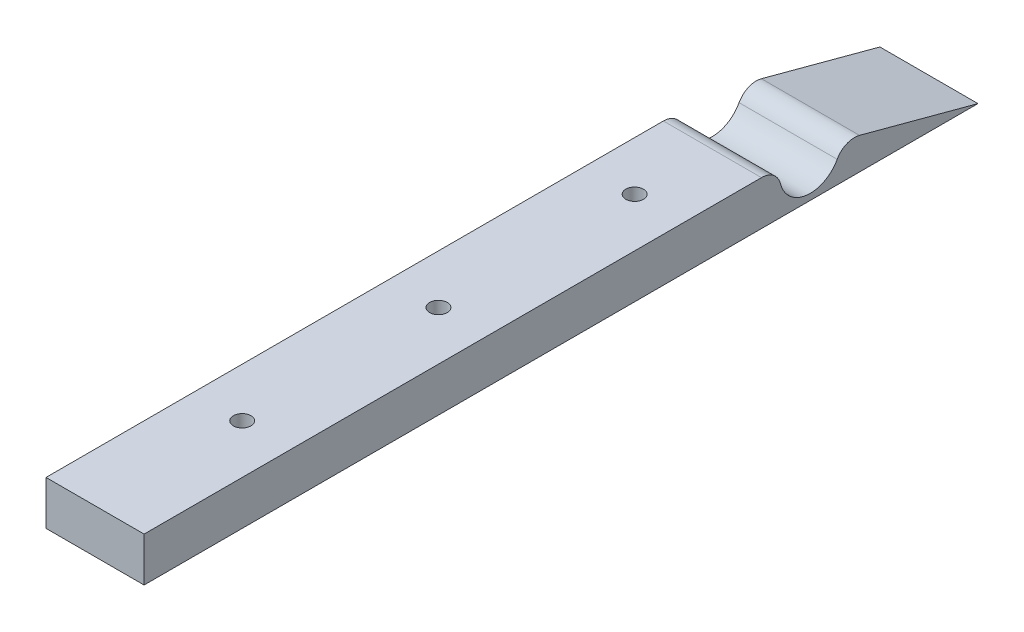
ISO-10303-21;
HEADER;
FILE_DESCRIPTION(('STEP AP214'),'2;1');
FILE_NAME('part.step','',(''),(''),'','','');
FILE_SCHEMA(('AUTOMOTIVE_DESIGN { 1 0 10303 214 1 1 1 1 }'));
ENDSEC;
DATA;
#1=APPLICATION_CONTEXT('core data for automotive mechanical design processes');
#2=APPLICATION_PROTOCOL_DEFINITION('international standard','automotive_design',2000,#1);
#3=PRODUCT_CONTEXT('',#1,'mechanical');
#4=PRODUCT('Part','Part','',(#3));
#5=PRODUCT_RELATED_PRODUCT_CATEGORY('part','',(#4));
#6=PRODUCT_DEFINITION_FORMATION('','',#4);
#7=PRODUCT_DEFINITION_CONTEXT('part definition',#1,'design');
#8=PRODUCT_DEFINITION('design','',#6,#7);
#9=PRODUCT_DEFINITION_SHAPE('','',#8);
#10=(LENGTH_UNIT() NAMED_UNIT(*) SI_UNIT(.MILLI.,.METRE.));
#11=(NAMED_UNIT(*) PLANE_ANGLE_UNIT() SI_UNIT($,.RADIAN.));
#12=(NAMED_UNIT(*) SI_UNIT($,.STERADIAN.) SOLID_ANGLE_UNIT());
#13=UNCERTAINTY_MEASURE_WITH_UNIT(LENGTH_MEASURE(1.E-05),#10,'distance_accuracy_value','');
#14=(GEOMETRIC_REPRESENTATION_CONTEXT(3) GLOBAL_UNCERTAINTY_ASSIGNED_CONTEXT((#13)) GLOBAL_UNIT_ASSIGNED_CONTEXT((#10,
#11,#12)) REPRESENTATION_CONTEXT('',''));
#15=CARTESIAN_POINT('',(0.,0.,0.));
#16=DIRECTION('',(0.,0.,1.));
#17=DIRECTION('',(1.,0.,0.));
#18=AXIS2_PLACEMENT_3D('',#15,#16,#17);
#19=CARTESIAN_POINT('',(12.6999999999996,11.43,-38.1));
#20=DIRECTION('',(0.,-1.,0.));
#21=DIRECTION('',(0.,0.,-1.));
#22=AXIS2_PLACEMENT_3D('',#19,#20,#21);
#23=CYLINDRICAL_SURFACE('',#22,2.286);
#24=CARTESIAN_POINT('',(12.6999999999996,11.43,-38.1));
#25=DIRECTION('',(0.,-1.,0.));
#26=DIRECTION('',(0.,0.,-1.));
#27=AXIS2_PLACEMENT_3D('',#24,#25,#26);
#28=CIRCLE('',#27,2.286);
#29=CARTESIAN_POINT('',(12.6999999999996,11.43,-40.386));
#30=VERTEX_POINT('',#29);
#31=EDGE_CURVE('E353',#30,#30,#28,.T.);
#32=ORIENTED_EDGE('',*,*,#31,.F.);
#33=EDGE_LOOP('',(#32));
#34=FACE_BOUND('',#33,.T.);
#35=CARTESIAN_POINT('',(12.6999999999996,6.35,-38.1));
#36=DIRECTION('',(0.,-1.,0.));
#37=DIRECTION('',(0.,0.,-1.));
#38=AXIS2_PLACEMENT_3D('',#35,#36,#37);
#39=CIRCLE('',#38,2.286);
#40=CARTESIAN_POINT('',(12.6999999999996,6.35,-40.386));
#41=VERTEX_POINT('',#40);
#42=EDGE_CURVE('E37',#41,#41,#39,.F.);
#43=ORIENTED_EDGE('',*,*,#42,.F.);
#44=EDGE_LOOP('',(#43));
#45=FACE_BOUND('',#44,.T.);
#46=ADVANCED_FACE('F33',(#34,#45),#23,.F.);
#47=CARTESIAN_POINT('',(12.6999999999998,11.43,-88.9));
#48=DIRECTION('',(0.,-1.,0.));
#49=DIRECTION('',(0.,0.,-1.));
#50=AXIS2_PLACEMENT_3D('',#47,#48,#49);
#51=CYLINDRICAL_SURFACE('',#50,2.286);
#52=CARTESIAN_POINT('',(12.6999999999998,11.43,-88.9));
#53=DIRECTION('',(0.,-1.,0.));
#54=DIRECTION('',(0.,0.,-1.));
#55=AXIS2_PLACEMENT_3D('',#52,#53,#54);
#56=CIRCLE('',#55,2.286);
#57=CARTESIAN_POINT('',(12.6999999999998,11.43,-91.186));
#58=VERTEX_POINT('',#57);
#59=EDGE_CURVE('E356',#58,#58,#56,.T.);
#60=ORIENTED_EDGE('',*,*,#59,.F.);
#61=EDGE_LOOP('',(#60));
#62=FACE_BOUND('',#61,.T.);
#63=CARTESIAN_POINT('',(12.6999999999998,6.35,-88.9));
#64=DIRECTION('',(0.,-1.,0.));
#65=DIRECTION('',(0.,0.,-1.));
#66=AXIS2_PLACEMENT_3D('',#63,#64,#65);
#67=CIRCLE('',#66,2.286);
#68=CARTESIAN_POINT('',(12.6999999999998,6.35,-91.186));
#69=VERTEX_POINT('',#68);
#70=EDGE_CURVE('E294',#69,#69,#67,.F.);
#71=ORIENTED_EDGE('',*,*,#70,.F.);
#72=EDGE_LOOP('',(#71));
#73=FACE_BOUND('',#72,.T.);
#74=ADVANCED_FACE('F415',(#62,#73),#51,.F.);
#75=CARTESIAN_POINT('',(12.7,11.43,-139.7));
#76=DIRECTION('',(0.,-1.,0.));
#77=DIRECTION('',(0.,0.,-1.));
#78=AXIS2_PLACEMENT_3D('',#75,#76,#77);
#79=CYLINDRICAL_SURFACE('',#78,2.286);
#80=CARTESIAN_POINT('',(12.7,11.43,-139.7));
#81=DIRECTION('',(0.,-1.,0.));
#82=DIRECTION('',(0.,0.,-1.));
#83=AXIS2_PLACEMENT_3D('',#80,#81,#82);
#84=CIRCLE('',#83,2.286);
#85=CARTESIAN_POINT('',(12.7,11.43,-141.986));
#86=VERTEX_POINT('',#85);
#87=EDGE_CURVE('E359',#86,#86,#84,.T.);
#88=ORIENTED_EDGE('',*,*,#87,.F.);
#89=EDGE_LOOP('',(#88));
#90=FACE_BOUND('',#89,.T.);
#91=CARTESIAN_POINT('',(12.7,6.35,-139.7));
#92=DIRECTION('',(0.,-1.,0.));
#93=DIRECTION('',(0.,0.,-1.));
#94=AXIS2_PLACEMENT_3D('',#91,#92,#93);
#95=CIRCLE('',#94,2.286);
#96=CARTESIAN_POINT('',(12.7,6.35,-141.986));
#97=VERTEX_POINT('',#96);
#98=EDGE_CURVE('E342',#97,#97,#95,.F.);
#99=ORIENTED_EDGE('',*,*,#98,.F.);
#100=EDGE_LOOP('',(#99));
#101=FACE_BOUND('',#100,.T.);
#102=ADVANCED_FACE('F417',(#90,#101),#79,.F.);
#103=CARTESIAN_POINT('',(25.4,0.,0.));
#104=DIRECTION('',(0.,0.,-1.));
#105=DIRECTION('',(-1.,0.,0.));
#106=AXIS2_PLACEMENT_3D('',#103,#104,#105);
#107=PLANE('',#106);
#108=DIRECTION('',(0.,-1.,0.));
#109=VECTOR('',#108,1.);
#110=CARTESIAN_POINT('',(0.,0.,0.));
#111=LINE('',#110,#109);
#112=CARTESIAN_POINT('',(0.,11.43,0.));
#113=VERTEX_POINT('',#112);
#114=CARTESIAN_POINT('',(0.,0.,0.));
#115=VERTEX_POINT('',#114);
#116=EDGE_CURVE('E362',#113,#115,#111,.T.);
#117=ORIENTED_EDGE('',*,*,#116,.T.);
#118=DIRECTION('',(-1.,0.,0.));
#119=VECTOR('',#118,1.);
#120=CARTESIAN_POINT('',(25.4,0.,0.));
#121=LINE('',#120,#119);
#122=CARTESIAN_POINT('',(25.4,0.,0.));
#123=VERTEX_POINT('',#122);
#124=EDGE_CURVE('E11',#123,#115,#121,.T.);
#125=ORIENTED_EDGE('',*,*,#124,.F.);
#126=DIRECTION('',(0.,-1.,0.));
#127=VECTOR('',#126,1.);
#128=CARTESIAN_POINT('',(25.4,0.,0.));
#129=LINE('',#128,#127);
#130=CARTESIAN_POINT('',(25.4,11.43,0.));
#131=VERTEX_POINT('',#130);
#132=EDGE_CURVE('E363',#131,#123,#129,.T.);
#133=ORIENTED_EDGE('',*,*,#132,.F.);
#134=DIRECTION('',(-1.,0.,0.));
#135=VECTOR('',#134,1.);
#136=CARTESIAN_POINT('',(25.4,11.43,0.));
#137=LINE('',#136,#135);
#138=EDGE_CURVE('E379',#131,#113,#137,.T.);
#139=ORIENTED_EDGE('',*,*,#138,.T.);
#140=EDGE_LOOP('',(#117,#125,#133,#139));
#141=FACE_BOUND('',#140,.T.);
#142=ADVANCED_FACE('F35',(#141),#107,.F.);
#143=CARTESIAN_POINT('',(25.4,0.,0.));
#144=DIRECTION('',(0.,1.,0.));
#145=DIRECTION('',(0.,0.,1.));
#146=AXIS2_PLACEMENT_3D('',#143,#144,#145);
#147=PLANE('',#146);
#148=DIRECTION('',(-0.5,0.,0.866025403784438));
#149=VECTOR('',#148,1.);
#150=CARTESIAN_POINT('',(18.1259378298438,0.,-38.1));
#151=LINE('',#150,#149);
#152=CARTESIAN_POINT('',(18.1259378298437,0.,-38.1));
#153=VERTEX_POINT('',#152);
#154=CARTESIAN_POINT('',(15.4129689149217,0.,-33.401));
#155=VERTEX_POINT('',#154);
#156=EDGE_CURVE('E238',#153,#155,#151,.T.);
#157=ORIENTED_EDGE('',*,*,#156,.F.);
#158=DIRECTION('',(0.500000000000001,0.,0.866025403784438));
#159=VECTOR('',#158,1.);
#160=CARTESIAN_POINT('',(15.4129689149217,0.,-42.799));
#161=LINE('',#160,#159);
#162=CARTESIAN_POINT('',(15.4129689149217,0.,-42.799));
#163=VERTEX_POINT('',#162);
#164=EDGE_CURVE('E50',#163,#153,#161,.T.);
#165=ORIENTED_EDGE('',*,*,#164,.F.);
#166=DIRECTION('',(1.,0.,0.));
#167=VECTOR('',#166,1.);
#168=CARTESIAN_POINT('',(9.98703108507759,0.,-42.799));
#169=LINE('',#168,#167);
#170=CARTESIAN_POINT('',(9.98703108507759,0.,-42.799));
#171=VERTEX_POINT('',#170);
#172=EDGE_CURVE('E224',#171,#163,#169,.T.);
#173=ORIENTED_EDGE('',*,*,#172,.F.);
#174=DIRECTION('',(0.500000000000001,0.,-0.866025403784438));
#175=VECTOR('',#174,1.);
#176=CARTESIAN_POINT('',(7.27406217015554,0.,-38.1));
#177=LINE('',#176,#175);
#178=CARTESIAN_POINT('',(7.27406217015554,0.,-38.1));
#179=VERTEX_POINT('',#178);
#180=EDGE_CURVE('E227',#179,#171,#177,.T.);
#181=ORIENTED_EDGE('',*,*,#180,.F.);
#182=DIRECTION('',(-0.5,0.,-0.866025403784438));
#183=VECTOR('',#182,1.);
#184=CARTESIAN_POINT('',(9.98703108507759,0.,-33.401));
#185=LINE('',#184,#183);
#186=CARTESIAN_POINT('',(9.98703108507759,0.,-33.401));
#187=VERTEX_POINT('',#186);
#188=EDGE_CURVE('E243',#187,#179,#185,.T.);
#189=ORIENTED_EDGE('',*,*,#188,.F.);
#190=DIRECTION('',(-1.,0.,0.));
#191=VECTOR('',#190,1.);
#192=CARTESIAN_POINT('',(15.4129689149217,0.,-33.401));
#193=LINE('',#192,#191);
#194=EDGE_CURVE('E240',#155,#187,#193,.T.);
#195=ORIENTED_EDGE('',*,*,#194,.F.);
#196=EDGE_LOOP('',(#157,#165,#173,#181,#189,#195));
#197=FACE_BOUND('',#196,.T.);
#198=DIRECTION('',(-0.5,0.,0.866025403784439));
#199=VECTOR('',#198,1.);
#200=CARTESIAN_POINT('',(18.1259378298439,0.,-88.9));
#201=LINE('',#200,#199);
#202=CARTESIAN_POINT('',(18.1259378298439,0.,-88.9));
#203=VERTEX_POINT('',#202);
#204=CARTESIAN_POINT('',(15.4129689149219,0.,-84.201));
#205=VERTEX_POINT('',#204);
#206=EDGE_CURVE('E278',#203,#205,#201,.T.);
#207=ORIENTED_EDGE('',*,*,#206,.F.);
#208=DIRECTION('',(0.499999999999999,0.,0.866025403784439));
#209=VECTOR('',#208,1.);
#210=CARTESIAN_POINT('',(15.4129689149219,0.,-93.599));
#211=LINE('',#210,#209);
#212=CARTESIAN_POINT('',(15.4129689149219,0.,-93.599));
#213=VERTEX_POINT('',#212);
#214=EDGE_CURVE('E58',#213,#203,#211,.T.);
#215=ORIENTED_EDGE('',*,*,#214,.F.);
#216=DIRECTION('',(1.,0.,0.));
#217=VECTOR('',#216,1.);
#218=CARTESIAN_POINT('',(9.98703108507777,0.,-93.599));
#219=LINE('',#218,#217);
#220=CARTESIAN_POINT('',(9.98703108507777,0.,-93.599));
#221=VERTEX_POINT('',#220);
#222=EDGE_CURVE('E261',#221,#213,#219,.T.);
#223=ORIENTED_EDGE('',*,*,#222,.F.);
#224=DIRECTION('',(0.499999999999999,0.,-0.866025403784439));
#225=VECTOR('',#224,1.);
#226=CARTESIAN_POINT('',(7.27406217015572,0.,-88.9));
#227=LINE('',#226,#225);
#228=CARTESIAN_POINT('',(7.27406217015572,0.,-88.9));
#229=VERTEX_POINT('',#228);
#230=EDGE_CURVE('E287',#229,#221,#227,.T.);
#231=ORIENTED_EDGE('',*,*,#230,.F.);
#232=DIRECTION('',(-0.5,0.,-0.866025403784438));
#233=VECTOR('',#232,1.);
#234=CARTESIAN_POINT('',(9.98703108507777,0.,-84.201));
#235=LINE('',#234,#233);
#236=CARTESIAN_POINT('',(9.98703108507777,0.,-84.201));
#237=VERTEX_POINT('',#236);
#238=EDGE_CURVE('E284',#237,#229,#235,.T.);
#239=ORIENTED_EDGE('',*,*,#238,.F.);
#240=DIRECTION('',(-1.,0.,0.));
#241=VECTOR('',#240,1.);
#242=CARTESIAN_POINT('',(15.4129689149219,0.,-84.201));
#243=LINE('',#242,#241);
#244=EDGE_CURVE('E281',#205,#237,#243,.T.);
#245=ORIENTED_EDGE('',*,*,#244,.F.);
#246=EDGE_LOOP('',(#207,#215,#223,#231,#239,#245));
#247=FACE_BOUND('',#246,.T.);
#248=DIRECTION('',(-0.500000000000001,0.,0.866025403784438));
#249=VECTOR('',#248,1.);
#250=CARTESIAN_POINT('',(18.1259378298441,0.,-139.7));
#251=LINE('',#250,#249);
#252=CARTESIAN_POINT('',(18.1259378298441,0.,-139.7));
#253=VERTEX_POINT('',#252);
#254=CARTESIAN_POINT('',(15.412968914922,0.,-135.001));
#255=VERTEX_POINT('',#254);
#256=EDGE_CURVE('E326',#253,#255,#251,.T.);
#257=ORIENTED_EDGE('',*,*,#256,.F.);
#258=DIRECTION('',(0.499999999999999,0.,0.866025403784439));
#259=VECTOR('',#258,1.);
#260=CARTESIAN_POINT('',(15.412968914922,0.,-144.399));
#261=LINE('',#260,#259);
#262=CARTESIAN_POINT('',(15.412968914922,0.,-144.399));
#263=VERTEX_POINT('',#262);
#264=EDGE_CURVE('E324',#263,#253,#261,.T.);
#265=ORIENTED_EDGE('',*,*,#264,.F.);
#266=DIRECTION('',(1.,0.,0.));
#267=VECTOR('',#266,1.);
#268=CARTESIAN_POINT('',(9.98703108507794,0.,-144.399));
#269=LINE('',#268,#267);
#270=CARTESIAN_POINT('',(9.98703108507794,0.,-144.399));
#271=VERTEX_POINT('',#270);
#272=EDGE_CURVE('E308',#271,#263,#269,.T.);
#273=ORIENTED_EDGE('',*,*,#272,.F.);
#274=DIRECTION('',(0.499999999999999,0.,-0.866025403784439));
#275=VECTOR('',#274,1.);
#276=CARTESIAN_POINT('',(7.27406217015589,0.,-139.7));
#277=LINE('',#276,#275);
#278=CARTESIAN_POINT('',(7.27406217015589,0.,-139.7));
#279=VERTEX_POINT('',#278);
#280=EDGE_CURVE('E335',#279,#271,#277,.T.);
#281=ORIENTED_EDGE('',*,*,#280,.F.);
#282=DIRECTION('',(-0.500000000000001,0.,-0.866025403784438));
#283=VECTOR('',#282,1.);
#284=CARTESIAN_POINT('',(9.98703108507794,0.,-135.001));
#285=LINE('',#284,#283);
#286=CARTESIAN_POINT('',(9.98703108507794,0.,-135.001));
#287=VERTEX_POINT('',#286);
#288=EDGE_CURVE('E332',#287,#279,#285,.T.);
#289=ORIENTED_EDGE('',*,*,#288,.F.);
#290=DIRECTION('',(-1.,0.,0.));
#291=VECTOR('',#290,1.);
#292=CARTESIAN_POINT('',(15.412968914922,0.,-135.001));
#293=LINE('',#292,#291);
#294=EDGE_CURVE('E329',#255,#287,#293,.T.);
#295=ORIENTED_EDGE('',*,*,#294,.F.);
#296=EDGE_LOOP('',(#257,#265,#273,#281,#289,#295));
#297=FACE_BOUND('',#296,.T.);
#298=DIRECTION('',(0.,0.,-1.));
#299=VECTOR('',#298,1.);
#300=CARTESIAN_POINT('',(0.,0.,0.));
#301=LINE('',#300,#299);
#302=CARTESIAN_POINT('',(0.,0.,-215.9));
#303=VERTEX_POINT('',#302);
#304=EDGE_CURVE('E382',#115,#303,#301,.T.);
#305=ORIENTED_EDGE('',*,*,#304,.T.);
#306=DIRECTION('',(-1.,0.,0.));
#307=VECTOR('',#306,1.);
#308=CARTESIAN_POINT('',(25.4,0.,-215.9));
#309=LINE('',#308,#307);
#310=CARTESIAN_POINT('',(25.4,0.,-215.9));
#311=VERTEX_POINT('',#310);
#312=EDGE_CURVE('E42',#311,#303,#309,.T.);
#313=ORIENTED_EDGE('',*,*,#312,.F.);
#314=DIRECTION('',(0.,0.,-1.));
#315=VECTOR('',#314,1.);
#316=CARTESIAN_POINT('',(25.4,0.,0.));
#317=LINE('',#316,#315);
#318=EDGE_CURVE('E366',#123,#311,#317,.T.);
#319=ORIENTED_EDGE('',*,*,#318,.F.);
#320=ORIENTED_EDGE('',*,*,#124,.T.);
#321=EDGE_LOOP('',(#305,#313,#319,#320));
#322=FACE_BOUND('',#321,.T.);
#323=ADVANCED_FACE('F458',(#197,#247,#297,#322),#147,.F.);
#324=CARTESIAN_POINT('',(25.4,0.,-215.9));
#325=DIRECTION('',(0.,-0.96592582628907,0.258819045102514));
#326=DIRECTION('',(0.,-0.258819045102514,-0.96592582628907));
#327=AXIS2_PLACEMENT_3D('',#324,#325,#326);
#328=PLANE('',#327);
#329=DIRECTION('',(0.,0.258819045102514,0.96592582628907));
#330=VECTOR('',#329,1.);
#331=CARTESIAN_POINT('',(0.,0.,-215.9));
#332=LINE('',#331,#330);
#333=CARTESIAN_POINT('',(0.,8.22046909248364,-185.220791684801));
#334=VERTEX_POINT('',#333);
#335=EDGE_CURVE('E384',#303,#334,#332,.T.);
#336=ORIENTED_EDGE('',*,*,#335,.T.);
#337=DIRECTION('',(-1.,0.,0.));
#338=VECTOR('',#337,1.);
#339=CARTESIAN_POINT('',(25.4,8.22046909248364,-185.220791684801));
#340=LINE('',#339,#338);
#341=CARTESIAN_POINT('',(25.4,8.22046909248364,-185.220791684801));
#342=VERTEX_POINT('',#341);
#343=EDGE_CURVE('E404',#342,#334,#340,.T.);
#344=ORIENTED_EDGE('',*,*,#343,.F.);
#345=DIRECTION('',(0.,0.258819045102514,0.96592582628907));
#346=VECTOR('',#345,1.);
#347=CARTESIAN_POINT('',(25.4,0.,-215.9));
#348=LINE('',#347,#346);
#349=EDGE_CURVE('E369',#311,#342,#348,.T.);
#350=ORIENTED_EDGE('',*,*,#349,.F.);
#351=ORIENTED_EDGE('',*,*,#312,.T.);
#352=EDGE_LOOP('',(#336,#344,#350,#351));
#353=FACE_BOUND('',#352,.T.);
#354=ADVANCED_FACE('F455',(#353),#328,.F.);
#355=CARTESIAN_POINT('',(25.4,3.31356589493516,-183.90599093568));
#356=DIRECTION('',(-1.,0.,0.));
#357=DIRECTION('',(0.,0.,1.));
#358=AXIS2_PLACEMENT_3D('',#355,#356,#357);
#359=CYLINDRICAL_SURFACE('',#358,5.07999999999999);
#360=CARTESIAN_POINT('',(0.,3.31356589493516,-183.90599093568));
#361=DIRECTION('',(1.,0.,0.));
#362=DIRECTION('',(0.,0.,-1.));
#363=AXIS2_PLACEMENT_3D('',#360,#361,#362);
#364=CIRCLE('',#363,5.07999999999999);
#365=CARTESIAN_POINT('',(0.,5.73754017983852,-179.441604229073));
#366=VERTEX_POINT('',#365);
#367=EDGE_CURVE('E386',#334,#366,#364,.T.);
#368=ORIENTED_EDGE('',*,*,#367,.T.);
#369=DIRECTION('',(-1.,0.,0.));
#370=VECTOR('',#369,1.);
#371=CARTESIAN_POINT('',(25.4,5.73754017983852,-179.441604229073));
#372=LINE('',#371,#370);
#373=CARTESIAN_POINT('',(25.4,5.73754017983852,-179.441604229073));
#374=VERTEX_POINT('',#373);
#375=EDGE_CURVE('E401',#374,#366,#372,.T.);
#376=ORIENTED_EDGE('',*,*,#375,.F.);
#377=CARTESIAN_POINT('',(25.4,3.31356589493516,-183.90599093568));
#378=DIRECTION('',(1.,0.,0.));
#379=DIRECTION('',(0.,0.,-1.));
#380=AXIS2_PLACEMENT_3D('',#377,#378,#379);
#381=CIRCLE('',#380,5.07999999999999);
#382=EDGE_CURVE('E371',#342,#374,#381,.T.);
#383=ORIENTED_EDGE('',*,*,#382,.F.);
#384=ORIENTED_EDGE('',*,*,#343,.T.);
#385=EDGE_LOOP('',(#368,#376,#383,#384));
#386=FACE_BOUND('',#385,.T.);
#387=ADVANCED_FACE('F451',(#386),#359,.T.);
#388=CARTESIAN_POINT('',(25.4,9.525,-172.466));
#389=DIRECTION('',(-1.,0.,0.));
#390=DIRECTION('',(0.,0.,1.));
#391=AXIS2_PLACEMENT_3D('',#388,#389,#390);
#392=CYLINDRICAL_SURFACE('',#391,7.9375);
#393=CARTESIAN_POINT('',(0.,9.525,-172.466));
#394=DIRECTION('',(-1.,0.,0.));
#395=DIRECTION('',(0.,0.,-1.));
#396=AXIS2_PLACEMENT_3D('',#393,#394,#395);
#397=CIRCLE('',#396,7.9375);
#398=CARTESIAN_POINT('',(0.,7.5890243902439,-164.768214299655));
#399=VERTEX_POINT('',#398);
#400=EDGE_CURVE('E388',#366,#399,#397,.T.);
#401=ORIENTED_EDGE('',*,*,#400,.T.);
#402=DIRECTION('',(-1.,0.,0.));
#403=VECTOR('',#402,1.);
#404=CARTESIAN_POINT('',(25.4,7.5890243902439,-164.768214299655));
#405=LINE('',#404,#403);
#406=CARTESIAN_POINT('',(25.4,7.5890243902439,-164.768214299655));
#407=VERTEX_POINT('',#406);
#408=EDGE_CURVE('E398',#407,#399,#405,.T.);
#409=ORIENTED_EDGE('',*,*,#408,.F.);
#410=CARTESIAN_POINT('',(25.4,9.525,-172.466));
#411=DIRECTION('',(-1.,0.,0.));
#412=DIRECTION('',(0.,0.,-1.));
#413=AXIS2_PLACEMENT_3D('',#410,#411,#412);
#414=CIRCLE('',#413,7.9375);
#415=EDGE_CURVE('E373',#374,#407,#414,.T.);
#416=ORIENTED_EDGE('',*,*,#415,.F.);
#417=ORIENTED_EDGE('',*,*,#375,.T.);
#418=EDGE_LOOP('',(#401,#409,#416,#417));
#419=FACE_BOUND('',#418,.T.);
#420=ADVANCED_FACE('F447',(#419),#392,.F.);
#421=CARTESIAN_POINT('',(25.4,6.35,-159.841631451435));
#422=DIRECTION('',(-1.,0.,0.));
#423=DIRECTION('',(0.,0.,1.));
#424=AXIS2_PLACEMENT_3D('',#421,#422,#423);
#425=CYLINDRICAL_SURFACE('',#424,5.08);
#426=CARTESIAN_POINT('',(0.,6.35,-159.841631451435));
#427=DIRECTION('',(1.,0.,0.));
#428=DIRECTION('',(0.,0.,1.));
#429=AXIS2_PLACEMENT_3D('',#426,#427,#428);
#430=CIRCLE('',#429,5.08);
#431=CARTESIAN_POINT('',(0.,11.43,-159.841631451435));
#432=VERTEX_POINT('',#431);
#433=EDGE_CURVE('E390',#399,#432,#430,.T.);
#434=ORIENTED_EDGE('',*,*,#433,.T.);
#435=DIRECTION('',(-1.,0.,0.));
#436=VECTOR('',#435,1.);
#437=CARTESIAN_POINT('',(25.4,11.43,-159.841631451435));
#438=LINE('',#437,#436);
#439=CARTESIAN_POINT('',(25.4,11.43,-159.841631451435));
#440=VERTEX_POINT('',#439);
#441=EDGE_CURVE('E395',#440,#432,#438,.T.);
#442=ORIENTED_EDGE('',*,*,#441,.F.);
#443=CARTESIAN_POINT('',(25.4,6.35,-159.841631451435));
#444=DIRECTION('',(1.,0.,0.));
#445=DIRECTION('',(0.,0.,1.));
#446=AXIS2_PLACEMENT_3D('',#443,#444,#445);
#447=CIRCLE('',#446,5.08);
#448=EDGE_CURVE('E375',#407,#440,#447,.T.);
#449=ORIENTED_EDGE('',*,*,#448,.F.);
#450=ORIENTED_EDGE('',*,*,#408,.T.);
#451=EDGE_LOOP('',(#434,#442,#449,#450));
#452=FACE_BOUND('',#451,.T.);
#453=ADVANCED_FACE('F443',(#452),#425,.T.);
#454=CARTESIAN_POINT('',(25.4,11.43,0.));
#455=DIRECTION('',(0.,-1.,0.));
#456=DIRECTION('',(0.,0.,-1.));
#457=AXIS2_PLACEMENT_3D('',#454,#455,#456);
#458=PLANE('',#457);
#459=ORIENTED_EDGE('',*,*,#31,.T.);
#460=EDGE_LOOP('',(#459));
#461=FACE_BOUND('',#460,.T.);
#462=ORIENTED_EDGE('',*,*,#59,.T.);
#463=EDGE_LOOP('',(#462));
#464=FACE_BOUND('',#463,.T.);
#465=ORIENTED_EDGE('',*,*,#87,.T.);
#466=EDGE_LOOP('',(#465));
#467=FACE_BOUND('',#466,.T.);
#468=DIRECTION('',(0.,0.,1.));
#469=VECTOR('',#468,1.);
#470=CARTESIAN_POINT('',(0.,11.43,0.));
#471=LINE('',#470,#469);
#472=EDGE_CURVE('E367',#432,#113,#471,.T.);
#473=ORIENTED_EDGE('',*,*,#472,.T.);
#474=ORIENTED_EDGE('',*,*,#138,.F.);
#475=DIRECTION('',(0.,0.,1.));
#476=VECTOR('',#475,1.);
#477=CARTESIAN_POINT('',(25.4,11.43,0.));
#478=LINE('',#477,#476);
#479=EDGE_CURVE('E377',#440,#131,#478,.T.);
#480=ORIENTED_EDGE('',*,*,#479,.F.);
#481=ORIENTED_EDGE('',*,*,#441,.T.);
#482=EDGE_LOOP('',(#473,#474,#480,#481));
#483=FACE_BOUND('',#482,.T.);
#484=ADVANCED_FACE('F435',(#461,#464,#467,#483),#458,.F.);
#485=CARTESIAN_POINT('',(25.4,6.35,-159.841631451435));
#486=DIRECTION('',(-1.,0.,0.));
#487=DIRECTION('',(0.,0.,1.));
#488=AXIS2_PLACEMENT_3D('',#485,#486,#487);
#489=PLANE('',#488);
#490=ORIENTED_EDGE('',*,*,#132,.T.);
#491=ORIENTED_EDGE('',*,*,#318,.T.);
#492=ORIENTED_EDGE('',*,*,#349,.T.);
#493=ORIENTED_EDGE('',*,*,#382,.T.);
#494=ORIENTED_EDGE('',*,*,#415,.T.);
#495=ORIENTED_EDGE('',*,*,#448,.T.);
#496=ORIENTED_EDGE('',*,*,#479,.T.);
#497=EDGE_LOOP('',(#490,#491,#492,#493,#494,#495,#496));
#498=FACE_BOUND('',#497,.T.);
#499=ADVANCED_FACE('F431',(#498),#489,.F.);
#500=CARTESIAN_POINT('',(0.,6.35,-159.841631451435));
#501=DIRECTION('',(-1.,0.,0.));
#502=DIRECTION('',(0.,0.,1.));
#503=AXIS2_PLACEMENT_3D('',#500,#501,#502);
#504=PLANE('',#503);
#505=ORIENTED_EDGE('',*,*,#116,.F.);
#506=ORIENTED_EDGE('',*,*,#472,.F.);
#507=ORIENTED_EDGE('',*,*,#433,.F.);
#508=ORIENTED_EDGE('',*,*,#400,.F.);
#509=ORIENTED_EDGE('',*,*,#367,.F.);
#510=ORIENTED_EDGE('',*,*,#335,.F.);
#511=ORIENTED_EDGE('',*,*,#304,.F.);
#512=EDGE_LOOP('',(#505,#506,#507,#508,#509,#510,#511));
#513=FACE_BOUND('',#512,.T.);
#514=ADVANCED_FACE('F434',(#513),#504,.T.);
#515=CARTESIAN_POINT('',(0.,6.35,0.));
#516=DIRECTION('',(0.,-1.,0.));
#517=DIRECTION('',(0.,0.,-1.));
#518=AXIS2_PLACEMENT_3D('',#515,#516,#517);
#519=PLANE('',#518);
#520=DIRECTION('',(0.499999999999999,0.,0.866025403784439));
#521=VECTOR('',#520,1.);
#522=CARTESIAN_POINT('',(15.412968914922,6.35,-144.399));
#523=LINE('',#522,#521);
#524=CARTESIAN_POINT('',(15.412968914922,6.35,-144.399));
#525=VERTEX_POINT('',#524);
#526=CARTESIAN_POINT('',(18.1259378298441,6.35,-139.7));
#527=VERTEX_POINT('',#526);
#528=EDGE_CURVE('E304',#525,#527,#523,.T.);
#529=ORIENTED_EDGE('',*,*,#528,.T.);
#530=DIRECTION('',(-0.500000000000001,0.,0.866025403784438));
#531=VECTOR('',#530,1.);
#532=CARTESIAN_POINT('',(18.1259378298441,6.35,-139.7));
#533=LINE('',#532,#531);
#534=CARTESIAN_POINT('',(15.412968914922,6.35,-135.001));
#535=VERTEX_POINT('',#534);
#536=EDGE_CURVE('E307',#527,#535,#533,.T.);
#537=ORIENTED_EDGE('',*,*,#536,.T.);
#538=DIRECTION('',(-1.,0.,0.));
#539=VECTOR('',#538,1.);
#540=CARTESIAN_POINT('',(15.412968914922,6.35,-135.001));
#541=LINE('',#540,#539);
#542=CARTESIAN_POINT('',(9.98703108507794,6.35,-135.001));
#543=VERTEX_POINT('',#542);
#544=EDGE_CURVE('E311',#535,#543,#541,.T.);
#545=ORIENTED_EDGE('',*,*,#544,.T.);
#546=DIRECTION('',(-0.500000000000001,0.,-0.866025403784438));
#547=VECTOR('',#546,1.);
#548=CARTESIAN_POINT('',(9.98703108507794,6.35,-135.001));
#549=LINE('',#548,#547);
#550=CARTESIAN_POINT('',(7.27406217015589,6.35,-139.7));
#551=VERTEX_POINT('',#550);
#552=EDGE_CURVE('E314',#543,#551,#549,.T.);
#553=ORIENTED_EDGE('',*,*,#552,.T.);
#554=DIRECTION('',(0.499999999999999,0.,-0.866025403784439));
#555=VECTOR('',#554,1.);
#556=CARTESIAN_POINT('',(7.27406217015589,6.35,-139.7));
#557=LINE('',#556,#555);
#558=CARTESIAN_POINT('',(9.98703108507794,6.35,-144.399));
#559=VERTEX_POINT('',#558);
#560=EDGE_CURVE('E317',#551,#559,#557,.T.);
#561=ORIENTED_EDGE('',*,*,#560,.T.);
#562=DIRECTION('',(1.,0.,0.));
#563=VECTOR('',#562,1.);
#564=CARTESIAN_POINT('',(9.98703108507794,6.35,-144.399));
#565=LINE('',#564,#563);
#566=EDGE_CURVE('E320',#559,#525,#565,.T.);
#567=ORIENTED_EDGE('',*,*,#566,.T.);
#568=EDGE_LOOP('',(#529,#537,#545,#553,#561,#567));
#569=FACE_BOUND('',#568,.T.);
#570=ORIENTED_EDGE('',*,*,#98,.T.);
#571=EDGE_LOOP('',(#570));
#572=FACE_BOUND('',#571,.T.);
#573=ADVANCED_FACE('F439',(#569,#572),#519,.T.);
#574=CARTESIAN_POINT('',(15.412968914922,6.35,-144.399));
#575=DIRECTION('',(0.866025403784439,0.,-0.499999999999999));
#576=DIRECTION('',(-0.499999999999999,0.,-0.866025403784439));
#577=AXIS2_PLACEMENT_3D('',#574,#575,#576);
#578=PLANE('',#577);
#579=ORIENTED_EDGE('',*,*,#264,.T.);
#580=DIRECTION('',(0.,-1.,0.));
#581=VECTOR('',#580,1.);
#582=CARTESIAN_POINT('',(18.1259378298441,6.35,-139.7));
#583=LINE('',#582,#581);
#584=EDGE_CURVE('E323',#527,#253,#583,.T.);
#585=ORIENTED_EDGE('',*,*,#584,.F.);
#586=ORIENTED_EDGE('',*,*,#528,.F.);
#587=DIRECTION('',(0.,-1.,0.));
#588=VECTOR('',#587,1.);
#589=CARTESIAN_POINT('',(15.412968914922,6.35,-144.399));
#590=LINE('',#589,#588);
#591=EDGE_CURVE('E340',#525,#263,#590,.T.);
#592=ORIENTED_EDGE('',*,*,#591,.T.);
#593=EDGE_LOOP('',(#579,#585,#586,#592));
#594=FACE_BOUND('',#593,.T.);
#595=ADVANCED_FACE('F505',(#594),#578,.F.);
#596=CARTESIAN_POINT('',(9.98703108507794,6.35,-144.399));
#597=DIRECTION('',(0.,0.,-1.));
#598=DIRECTION('',(-1.,0.,0.));
#599=AXIS2_PLACEMENT_3D('',#596,#597,#598);
#600=PLANE('',#599);
#601=ORIENTED_EDGE('',*,*,#272,.T.);
#602=ORIENTED_EDGE('',*,*,#591,.F.);
#603=ORIENTED_EDGE('',*,*,#566,.F.);
#604=DIRECTION('',(0.,-1.,0.));
#605=VECTOR('',#604,1.);
#606=CARTESIAN_POINT('',(9.98703108507794,6.35,-144.399));
#607=LINE('',#606,#605);
#608=EDGE_CURVE('E343',#559,#271,#607,.T.);
#609=ORIENTED_EDGE('',*,*,#608,.T.);
#610=EDGE_LOOP('',(#601,#602,#603,#609));
#611=FACE_BOUND('',#610,.T.);
#612=ADVANCED_FACE('F508',(#611),#600,.F.);
#613=CARTESIAN_POINT('',(7.27406217015589,6.35,-139.7));
#614=DIRECTION('',(-0.866025403784439,0.,-0.499999999999999));
#615=DIRECTION('',(-0.499999999999999,0.,0.866025403784439));
#616=AXIS2_PLACEMENT_3D('',#613,#614,#615);
#617=PLANE('',#616);
#618=ORIENTED_EDGE('',*,*,#280,.T.);
#619=ORIENTED_EDGE('',*,*,#608,.F.);
#620=ORIENTED_EDGE('',*,*,#560,.F.);
#621=DIRECTION('',(0.,-1.,0.));
#622=VECTOR('',#621,1.);
#623=CARTESIAN_POINT('',(7.27406217015589,6.35,-139.7));
#624=LINE('',#623,#622);
#625=EDGE_CURVE('E345',#551,#279,#624,.T.);
#626=ORIENTED_EDGE('',*,*,#625,.T.);
#627=EDGE_LOOP('',(#618,#619,#620,#626));
#628=FACE_BOUND('',#627,.T.);
#629=ADVANCED_FACE('F511',(#628),#617,.F.);
#630=CARTESIAN_POINT('',(9.98703108507794,6.35,-135.001));
#631=DIRECTION('',(-0.866025403784438,0.,0.500000000000001));
#632=DIRECTION('',(0.500000000000001,0.,0.866025403784438));
#633=AXIS2_PLACEMENT_3D('',#630,#631,#632);
#634=PLANE('',#633);
#635=ORIENTED_EDGE('',*,*,#288,.T.);
#636=ORIENTED_EDGE('',*,*,#625,.F.);
#637=ORIENTED_EDGE('',*,*,#552,.F.);
#638=DIRECTION('',(0.,-1.,0.));
#639=VECTOR('',#638,1.);
#640=CARTESIAN_POINT('',(9.98703108507794,6.35,-135.001));
#641=LINE('',#640,#639);
#642=EDGE_CURVE('E347',#543,#287,#641,.T.);
#643=ORIENTED_EDGE('',*,*,#642,.T.);
#644=EDGE_LOOP('',(#635,#636,#637,#643));
#645=FACE_BOUND('',#644,.T.);
#646=ADVANCED_FACE('F515',(#645),#634,.F.);
#647=CARTESIAN_POINT('',(15.412968914922,6.35,-135.001));
#648=DIRECTION('',(0.,0.,1.));
#649=DIRECTION('',(1.,0.,0.));
#650=AXIS2_PLACEMENT_3D('',#647,#648,#649);
#651=PLANE('',#650);
#652=ORIENTED_EDGE('',*,*,#294,.T.);
#653=ORIENTED_EDGE('',*,*,#642,.F.);
#654=ORIENTED_EDGE('',*,*,#544,.F.);
#655=DIRECTION('',(0.,-1.,0.));
#656=VECTOR('',#655,1.);
#657=CARTESIAN_POINT('',(15.412968914922,6.35,-135.001));
#658=LINE('',#657,#656);
#659=EDGE_CURVE('E349',#535,#255,#658,.T.);
#660=ORIENTED_EDGE('',*,*,#659,.T.);
#661=EDGE_LOOP('',(#652,#653,#654,#660));
#662=FACE_BOUND('',#661,.T.);
#663=ADVANCED_FACE('F517',(#662),#651,.F.);
#664=CARTESIAN_POINT('',(18.1259378298441,6.35,-139.7));
#665=DIRECTION('',(0.866025403784438,0.,0.500000000000001));
#666=DIRECTION('',(0.500000000000001,0.,-0.866025403784438));
#667=AXIS2_PLACEMENT_3D('',#664,#665,#666);
#668=PLANE('',#667);
#669=ORIENTED_EDGE('',*,*,#256,.T.);
#670=ORIENTED_EDGE('',*,*,#659,.F.);
#671=ORIENTED_EDGE('',*,*,#536,.F.);
#672=ORIENTED_EDGE('',*,*,#584,.T.);
#673=EDGE_LOOP('',(#669,#670,#671,#672));
#674=FACE_BOUND('',#673,.T.);
#675=ADVANCED_FACE('F500',(#674),#668,.F.);
#676=CARTESIAN_POINT('',(0.,6.35,0.));
#677=DIRECTION('',(0.,-1.,0.));
#678=DIRECTION('',(0.,0.,-1.));
#679=AXIS2_PLACEMENT_3D('',#676,#677,#678);
#680=PLANE('',#679);
#681=DIRECTION('',(0.499999999999999,0.,0.866025403784439));
#682=VECTOR('',#681,1.);
#683=CARTESIAN_POINT('',(15.4129689149219,6.35,-93.599));
#684=LINE('',#683,#682);
#685=CARTESIAN_POINT('',(15.4129689149219,6.35,-93.599));
#686=VERTEX_POINT('',#685);
#687=CARTESIAN_POINT('',(18.1259378298439,6.35,-88.9));
#688=VERTEX_POINT('',#687);
#689=EDGE_CURVE('E257',#686,#688,#684,.T.);
#690=ORIENTED_EDGE('',*,*,#689,.T.);
#691=DIRECTION('',(-0.5,0.,0.866025403784439));
#692=VECTOR('',#691,1.);
#693=CARTESIAN_POINT('',(18.1259378298439,6.35,-88.9));
#694=LINE('',#693,#692);
#695=CARTESIAN_POINT('',(15.4129689149219,6.35,-84.201));
#696=VERTEX_POINT('',#695);
#697=EDGE_CURVE('E260',#688,#696,#694,.T.);
#698=ORIENTED_EDGE('',*,*,#697,.T.);
#699=DIRECTION('',(-1.,0.,0.));
#700=VECTOR('',#699,1.);
#701=CARTESIAN_POINT('',(15.4129689149219,6.35,-84.201));
#702=LINE('',#701,#700);
#703=CARTESIAN_POINT('',(9.98703108507777,6.35,-84.201));
#704=VERTEX_POINT('',#703);
#705=EDGE_CURVE('E264',#696,#704,#702,.T.);
#706=ORIENTED_EDGE('',*,*,#705,.T.);
#707=DIRECTION('',(-0.5,0.,-0.866025403784438));
#708=VECTOR('',#707,1.);
#709=CARTESIAN_POINT('',(9.98703108507777,6.35,-84.201));
#710=LINE('',#709,#708);
#711=CARTESIAN_POINT('',(7.27406217015572,6.35,-88.9));
#712=VERTEX_POINT('',#711);
#713=EDGE_CURVE('E267',#704,#712,#710,.T.);
#714=ORIENTED_EDGE('',*,*,#713,.T.);
#715=DIRECTION('',(0.499999999999999,0.,-0.866025403784439));
#716=VECTOR('',#715,1.);
#717=CARTESIAN_POINT('',(7.27406217015572,6.35,-88.9));
#718=LINE('',#717,#716);
#719=CARTESIAN_POINT('',(9.98703108507777,6.35,-93.599));
#720=VERTEX_POINT('',#719);
#721=EDGE_CURVE('E270',#712,#720,#718,.T.);
#722=ORIENTED_EDGE('',*,*,#721,.T.);
#723=DIRECTION('',(1.,0.,0.));
#724=VECTOR('',#723,1.);
#725=CARTESIAN_POINT('',(9.98703108507777,6.35,-93.599));
#726=LINE('',#725,#724);
#727=EDGE_CURVE('E273',#720,#686,#726,.T.);
#728=ORIENTED_EDGE('',*,*,#727,.T.);
#729=EDGE_LOOP('',(#690,#698,#706,#714,#722,#728));
#730=FACE_BOUND('',#729,.T.);
#731=ORIENTED_EDGE('',*,*,#70,.T.);
#732=EDGE_LOOP('',(#731));
#733=FACE_BOUND('',#732,.T.);
#734=ADVANCED_FACE('F413',(#730,#733),#680,.T.);
#735=CARTESIAN_POINT('',(15.4129689149219,6.35,-93.599));
#736=DIRECTION('',(0.866025403784439,0.,-0.499999999999999));
#737=DIRECTION('',(-0.499999999999999,0.,-0.866025403784439));
#738=AXIS2_PLACEMENT_3D('',#735,#736,#737);
#739=PLANE('',#738);
#740=ORIENTED_EDGE('',*,*,#214,.T.);
#741=DIRECTION('',(0.,-1.,0.));
#742=VECTOR('',#741,1.);
#743=CARTESIAN_POINT('',(18.1259378298439,6.35,-88.9));
#744=LINE('',#743,#742);
#745=EDGE_CURVE('E276',#688,#203,#744,.T.);
#746=ORIENTED_EDGE('',*,*,#745,.F.);
#747=ORIENTED_EDGE('',*,*,#689,.F.);
#748=DIRECTION('',(0.,-1.,0.));
#749=VECTOR('',#748,1.);
#750=CARTESIAN_POINT('',(15.4129689149219,6.35,-93.599));
#751=LINE('',#750,#749);
#752=EDGE_CURVE('E292',#686,#213,#751,.T.);
#753=ORIENTED_EDGE('',*,*,#752,.T.);
#754=EDGE_LOOP('',(#740,#746,#747,#753));
#755=FACE_BOUND('',#754,.T.);
#756=ADVANCED_FACE('F528',(#755),#739,.F.);
#757=CARTESIAN_POINT('',(9.98703108507777,6.35,-93.599));
#758=DIRECTION('',(0.,0.,-1.));
#759=DIRECTION('',(-1.,0.,0.));
#760=AXIS2_PLACEMENT_3D('',#757,#758,#759);
#761=PLANE('',#760);
#762=ORIENTED_EDGE('',*,*,#222,.T.);
#763=ORIENTED_EDGE('',*,*,#752,.F.);
#764=ORIENTED_EDGE('',*,*,#727,.F.);
#765=DIRECTION('',(0.,-1.,0.));
#766=VECTOR('',#765,1.);
#767=CARTESIAN_POINT('',(9.98703108507777,6.35,-93.599));
#768=LINE('',#767,#766);
#769=EDGE_CURVE('E295',#720,#221,#768,.T.);
#770=ORIENTED_EDGE('',*,*,#769,.T.);
#771=EDGE_LOOP('',(#762,#763,#764,#770));
#772=FACE_BOUND('',#771,.T.);
#773=ADVANCED_FACE('F547',(#772),#761,.F.);
#774=CARTESIAN_POINT('',(7.27406217015572,6.35,-88.9));
#775=DIRECTION('',(-0.866025403784439,0.,-0.499999999999999));
#776=DIRECTION('',(-0.499999999999999,0.,0.866025403784439));
#777=AXIS2_PLACEMENT_3D('',#774,#775,#776);
#778=PLANE('',#777);
#779=ORIENTED_EDGE('',*,*,#230,.T.);
#780=ORIENTED_EDGE('',*,*,#769,.F.);
#781=ORIENTED_EDGE('',*,*,#721,.F.);
#782=DIRECTION('',(0.,-1.,0.));
#783=VECTOR('',#782,1.);
#784=CARTESIAN_POINT('',(7.27406217015572,6.35,-88.9));
#785=LINE('',#784,#783);
#786=EDGE_CURVE('E297',#712,#229,#785,.T.);
#787=ORIENTED_EDGE('',*,*,#786,.T.);
#788=EDGE_LOOP('',(#779,#780,#781,#787));
#789=FACE_BOUND('',#788,.T.);
#790=ADVANCED_FACE('F553',(#789),#778,.F.);
#791=CARTESIAN_POINT('',(9.98703108507777,6.35,-84.201));
#792=DIRECTION('',(-0.866025403784438,0.,0.5));
#793=DIRECTION('',(0.5,0.,0.866025403784438));
#794=AXIS2_PLACEMENT_3D('',#791,#792,#793);
#795=PLANE('',#794);
#796=ORIENTED_EDGE('',*,*,#238,.T.);
#797=ORIENTED_EDGE('',*,*,#786,.F.);
#798=ORIENTED_EDGE('',*,*,#713,.F.);
#799=DIRECTION('',(0.,-1.,0.));
#800=VECTOR('',#799,1.);
#801=CARTESIAN_POINT('',(9.98703108507777,6.35,-84.201));
#802=LINE('',#801,#800);
#803=EDGE_CURVE('E299',#704,#237,#802,.T.);
#804=ORIENTED_EDGE('',*,*,#803,.T.);
#805=EDGE_LOOP('',(#796,#797,#798,#804));
#806=FACE_BOUND('',#805,.T.);
#807=ADVANCED_FACE('F557',(#806),#795,.F.);
#808=CARTESIAN_POINT('',(15.4129689149219,6.35,-84.201));
#809=DIRECTION('',(0.,0.,1.));
#810=DIRECTION('',(1.,0.,0.));
#811=AXIS2_PLACEMENT_3D('',#808,#809,#810);
#812=PLANE('',#811);
#813=ORIENTED_EDGE('',*,*,#244,.T.);
#814=ORIENTED_EDGE('',*,*,#803,.F.);
#815=ORIENTED_EDGE('',*,*,#705,.F.);
#816=DIRECTION('',(0.,-1.,0.));
#817=VECTOR('',#816,1.);
#818=CARTESIAN_POINT('',(15.4129689149219,6.35,-84.201));
#819=LINE('',#818,#817);
#820=EDGE_CURVE('E301',#696,#205,#819,.T.);
#821=ORIENTED_EDGE('',*,*,#820,.T.);
#822=EDGE_LOOP('',(#813,#814,#815,#821));
#823=FACE_BOUND('',#822,.T.);
#824=ADVANCED_FACE('F561',(#823),#812,.F.);
#825=CARTESIAN_POINT('',(18.1259378298439,6.35,-88.9));
#826=DIRECTION('',(0.866025403784439,0.,0.5));
#827=DIRECTION('',(0.5,0.,-0.866025403784439));
#828=AXIS2_PLACEMENT_3D('',#825,#826,#827);
#829=PLANE('',#828);
#830=ORIENTED_EDGE('',*,*,#206,.T.);
#831=ORIENTED_EDGE('',*,*,#820,.F.);
#832=ORIENTED_EDGE('',*,*,#697,.F.);
#833=ORIENTED_EDGE('',*,*,#745,.T.);
#834=EDGE_LOOP('',(#830,#831,#832,#833));
#835=FACE_BOUND('',#834,.T.);
#836=ADVANCED_FACE('F564',(#835),#829,.F.);
#837=CARTESIAN_POINT('',(0.,6.35,0.));
#838=DIRECTION('',(0.,-1.,0.));
#839=DIRECTION('',(0.,0.,-1.));
#840=AXIS2_PLACEMENT_3D('',#837,#838,#839);
#841=PLANE('',#840);
#842=DIRECTION('',(0.500000000000001,0.,0.866025403784438));
#843=VECTOR('',#842,1.);
#844=CARTESIAN_POINT('',(15.4129689149217,6.35,-42.799));
#845=LINE('',#844,#843);
#846=CARTESIAN_POINT('',(15.4129689149217,6.35,-42.799));
#847=VERTEX_POINT('',#846);
#848=CARTESIAN_POINT('',(18.1259378298438,6.35,-38.1));
#849=VERTEX_POINT('',#848);
#850=EDGE_CURVE('E204',#847,#849,#845,.T.);
#851=ORIENTED_EDGE('',*,*,#850,.T.);
#852=DIRECTION('',(-0.5,0.,0.866025403784438));
#853=VECTOR('',#852,1.);
#854=CARTESIAN_POINT('',(18.1259378298438,6.35,-38.1));
#855=LINE('',#854,#853);
#856=CARTESIAN_POINT('',(15.4129689149217,6.35,-33.401));
#857=VERTEX_POINT('',#856);
#858=EDGE_CURVE('E213',#849,#857,#855,.T.);
#859=ORIENTED_EDGE('',*,*,#858,.T.);
#860=DIRECTION('',(-1.,0.,0.));
#861=VECTOR('',#860,1.);
#862=CARTESIAN_POINT('',(15.4129689149217,6.35,-33.401));
#863=LINE('',#862,#861);
#864=CARTESIAN_POINT('',(9.98703108507759,6.35,-33.401));
#865=VERTEX_POINT('',#864);
#866=EDGE_CURVE('E218',#857,#865,#863,.T.);
#867=ORIENTED_EDGE('',*,*,#866,.T.);
#868=DIRECTION('',(-0.5,0.,-0.866025403784438));
#869=VECTOR('',#868,1.);
#870=CARTESIAN_POINT('',(9.98703108507759,6.35,-33.401));
#871=LINE('',#870,#869);
#872=CARTESIAN_POINT('',(7.27406217015554,6.35,-38.1));
#873=VERTEX_POINT('',#872);
#874=EDGE_CURVE('E231',#865,#873,#871,.T.);
#875=ORIENTED_EDGE('',*,*,#874,.T.);
#876=DIRECTION('',(0.500000000000001,0.,-0.866025403784438));
#877=VECTOR('',#876,1.);
#878=CARTESIAN_POINT('',(7.27406217015554,6.35,-38.1));
#879=LINE('',#878,#877);
#880=CARTESIAN_POINT('',(9.98703108507759,6.35,-42.799));
#881=VERTEX_POINT('',#880);
#882=EDGE_CURVE('E234',#873,#881,#879,.T.);
#883=ORIENTED_EDGE('',*,*,#882,.T.);
#884=DIRECTION('',(1.,0.,0.));
#885=VECTOR('',#884,1.);
#886=CARTESIAN_POINT('',(9.98703108507759,6.35,-42.799));
#887=LINE('',#886,#885);
#888=EDGE_CURVE('E210',#881,#847,#887,.T.);
#889=ORIENTED_EDGE('',*,*,#888,.T.);
#890=EDGE_LOOP('',(#851,#859,#867,#875,#883,#889));
#891=FACE_BOUND('',#890,.T.);
#892=ORIENTED_EDGE('',*,*,#42,.T.);
#893=EDGE_LOOP('',(#892));
#894=FACE_BOUND('',#893,.T.);
#895=ADVANCED_FACE('F220',(#891,#894),#841,.T.);
#896=CARTESIAN_POINT('',(15.4129689149217,6.35,-42.799));
#897=DIRECTION('',(0.866025403784438,0.,-0.500000000000001));
#898=DIRECTION('',(-0.500000000000001,0.,-0.866025403784438));
#899=AXIS2_PLACEMENT_3D('',#896,#897,#898);
#900=PLANE('',#899);
#901=ORIENTED_EDGE('',*,*,#164,.T.);
#902=DIRECTION('',(0.,-1.,0.));
#903=VECTOR('',#902,1.);
#904=CARTESIAN_POINT('',(18.1259378298438,6.35,-38.1));
#905=LINE('',#904,#903);
#906=EDGE_CURVE('E200',#849,#153,#905,.T.);
#907=ORIENTED_EDGE('',*,*,#906,.F.);
#908=ORIENTED_EDGE('',*,*,#850,.F.);
#909=DIRECTION('',(0.,-1.,0.));
#910=VECTOR('',#909,1.);
#911=CARTESIAN_POINT('',(15.4129689149217,6.35,-42.799));
#912=LINE('',#911,#910);
#913=EDGE_CURVE('E248',#847,#163,#912,.T.);
#914=ORIENTED_EDGE('',*,*,#913,.T.);
#915=EDGE_LOOP('',(#901,#907,#908,#914));
#916=FACE_BOUND('',#915,.T.);
#917=ADVANCED_FACE('F202',(#916),#900,.F.);
#918=CARTESIAN_POINT('',(9.98703108507759,6.35,-42.799));
#919=DIRECTION('',(0.,0.,-1.));
#920=DIRECTION('',(-1.,0.,0.));
#921=AXIS2_PLACEMENT_3D('',#918,#919,#920);
#922=PLANE('',#921);
#923=ORIENTED_EDGE('',*,*,#172,.T.);
#924=ORIENTED_EDGE('',*,*,#913,.F.);
#925=ORIENTED_EDGE('',*,*,#888,.F.);
#926=DIRECTION('',(0.,-1.,0.));
#927=VECTOR('',#926,1.);
#928=CARTESIAN_POINT('',(9.98703108507759,6.35,-42.799));
#929=LINE('',#928,#927);
#930=EDGE_CURVE('E250',#881,#171,#929,.T.);
#931=ORIENTED_EDGE('',*,*,#930,.T.);
#932=EDGE_LOOP('',(#923,#924,#925,#931));
#933=FACE_BOUND('',#932,.T.);
#934=ADVANCED_FACE('F584',(#933),#922,.F.);
#935=CARTESIAN_POINT('',(7.27406217015554,6.35,-38.1));
#936=DIRECTION('',(-0.866025403784438,0.,-0.500000000000001));
#937=DIRECTION('',(-0.500000000000001,0.,0.866025403784438));
#938=AXIS2_PLACEMENT_3D('',#935,#936,#937);
#939=PLANE('',#938);
#940=ORIENTED_EDGE('',*,*,#180,.T.);
#941=ORIENTED_EDGE('',*,*,#930,.F.);
#942=ORIENTED_EDGE('',*,*,#882,.F.);
#943=DIRECTION('',(0.,-1.,0.));
#944=VECTOR('',#943,1.);
#945=CARTESIAN_POINT('',(7.27406217015554,6.35,-38.1));
#946=LINE('',#945,#944);
#947=EDGE_CURVE('E252',#873,#179,#946,.T.);
#948=ORIENTED_EDGE('',*,*,#947,.T.);
#949=EDGE_LOOP('',(#940,#941,#942,#948));
#950=FACE_BOUND('',#949,.T.);
#951=ADVANCED_FACE('F588',(#950),#939,.F.);
#952=CARTESIAN_POINT('',(9.98703108507759,6.35,-33.401));
#953=DIRECTION('',(-0.866025403784438,0.,0.5));
#954=DIRECTION('',(0.5,0.,0.866025403784439));
#955=AXIS2_PLACEMENT_3D('',#952,#953,#954);
#956=PLANE('',#955);
#957=ORIENTED_EDGE('',*,*,#188,.T.);
#958=ORIENTED_EDGE('',*,*,#947,.F.);
#959=ORIENTED_EDGE('',*,*,#874,.F.);
#960=DIRECTION('',(0.,-1.,0.));
#961=VECTOR('',#960,1.);
#962=CARTESIAN_POINT('',(9.98703108507759,6.35,-33.401));
#963=LINE('',#962,#961);
#964=EDGE_CURVE('E254',#865,#187,#963,.T.);
#965=ORIENTED_EDGE('',*,*,#964,.T.);
#966=EDGE_LOOP('',(#957,#958,#959,#965));
#967=FACE_BOUND('',#966,.T.);
#968=ADVANCED_FACE('F592',(#967),#956,.F.);
#969=CARTESIAN_POINT('',(15.4129689149217,6.35,-33.401));
#970=DIRECTION('',(0.,0.,1.));
#971=DIRECTION('',(1.,0.,0.));
#972=AXIS2_PLACEMENT_3D('',#969,#970,#971);
#973=PLANE('',#972);
#974=ORIENTED_EDGE('',*,*,#194,.T.);
#975=ORIENTED_EDGE('',*,*,#964,.F.);
#976=ORIENTED_EDGE('',*,*,#866,.F.);
#977=DIRECTION('',(0.,-1.,0.));
#978=VECTOR('',#977,1.);
#979=CARTESIAN_POINT('',(15.4129689149217,6.35,-33.401));
#980=LINE('',#979,#978);
#981=EDGE_CURVE('E209',#857,#155,#980,.T.);
#982=ORIENTED_EDGE('',*,*,#981,.T.);
#983=EDGE_LOOP('',(#974,#975,#976,#982));
#984=FACE_BOUND('',#983,.T.);
#985=ADVANCED_FACE('F596',(#984),#973,.F.);
#986=CARTESIAN_POINT('',(18.1259378298438,6.35,-38.1));
#987=DIRECTION('',(0.866025403784438,0.,0.5));
#988=DIRECTION('',(0.5,0.,-0.866025403784438));
#989=AXIS2_PLACEMENT_3D('',#986,#987,#988);
#990=PLANE('',#989);
#991=ORIENTED_EDGE('',*,*,#156,.T.);
#992=ORIENTED_EDGE('',*,*,#981,.F.);
#993=ORIENTED_EDGE('',*,*,#858,.F.);
#994=ORIENTED_EDGE('',*,*,#906,.T.);
#995=EDGE_LOOP('',(#991,#992,#993,#994));
#996=FACE_BOUND('',#995,.T.);
#997=ADVANCED_FACE('F214',(#996),#990,.F.);
#998=CLOSED_SHELL('',(#46,#74,#102,#142,#323,#354,#387,#420,#453,#484,#499,#514,#573,#595,#612,
#629,#646,#663,#675,#734,#756,#773,#790,#807,#824,#836,#895,#917,#934,#951,#968,#985,#997));
#999=MANIFOLD_SOLID_BREP('B2',#998);
#1000=ADVANCED_BREP_SHAPE_REPRESENTATION('',(#18,#999),#14);
#1001=SHAPE_DEFINITION_REPRESENTATION(#9,#1000);
ENDSEC;
END-ISO-10303-21;
